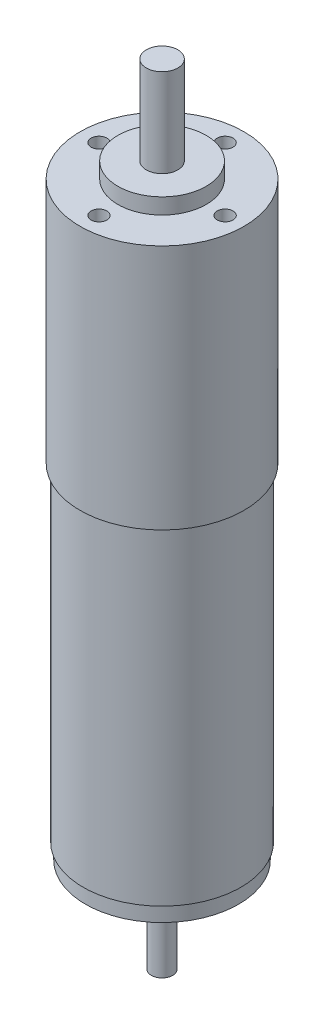
ISO-10303-21;
HEADER;
FILE_DESCRIPTION(('STEP AP214'),'2;1');
FILE_NAME('part.step','',(''),(''),'','','');
FILE_SCHEMA(('AUTOMOTIVE_DESIGN { 1 0 10303 214 1 1 1 1 }'));
ENDSEC;
DATA;
#1=APPLICATION_CONTEXT('core data for automotive mechanical design processes');
#2=APPLICATION_PROTOCOL_DEFINITION('international standard','automotive_design',2000,#1);
#3=PRODUCT_CONTEXT('',#1,'mechanical');
#4=PRODUCT('Part','Part','',(#3));
#5=PRODUCT_RELATED_PRODUCT_CATEGORY('part','',(#4));
#6=PRODUCT_DEFINITION_FORMATION('','',#4);
#7=PRODUCT_DEFINITION_CONTEXT('part definition',#1,'design');
#8=PRODUCT_DEFINITION('design','',#6,#7);
#9=PRODUCT_DEFINITION_SHAPE('','',#8);
#10=(LENGTH_UNIT() NAMED_UNIT(*) SI_UNIT(.MILLI.,.METRE.));
#11=(NAMED_UNIT(*) PLANE_ANGLE_UNIT() SI_UNIT($,.RADIAN.));
#12=(NAMED_UNIT(*) SI_UNIT($,.STERADIAN.) SOLID_ANGLE_UNIT());
#13=UNCERTAINTY_MEASURE_WITH_UNIT(LENGTH_MEASURE(1.E-05),#10,'distance_accuracy_value','');
#14=(GEOMETRIC_REPRESENTATION_CONTEXT(3) GLOBAL_UNCERTAINTY_ASSIGNED_CONTEXT((#13)) GLOBAL_UNIT_ASSIGNED_CONTEXT((#10,
#11,#12)) REPRESENTATION_CONTEXT('',''));
#15=CARTESIAN_POINT('',(0.,0.,0.));
#16=DIRECTION('',(0.,0.,1.));
#17=DIRECTION('',(1.,0.,0.));
#18=AXIS2_PLACEMENT_3D('',#15,#16,#17);
#19=CARTESIAN_POINT('',(0.,0.,0.));
#20=DIRECTION('',(0.,-1.,0.));
#21=DIRECTION('',(0.,0.,-1.));
#22=AXIS2_PLACEMENT_3D('',#19,#20,#21);
#23=PLANE('',#22);
#24=CARTESIAN_POINT('',(0.,0.,0.));
#25=DIRECTION('',(0.,-1.,0.));
#26=DIRECTION('',(0.,0.,-1.));
#27=AXIS2_PLACEMENT_3D('',#24,#25,#26);
#28=CIRCLE('',#27,12.15);
#29=CARTESIAN_POINT('',(0.,0.,-12.15));
#30=VERTEX_POINT('',#29);
#31=EDGE_CURVE('E10',#30,#30,#28,.T.);
#32=ORIENTED_EDGE('',*,*,#31,.T.);
#33=EDGE_LOOP('',(#32));
#34=FACE_BOUND('',#33,.T.);
#35=CARTESIAN_POINT('',(0.,0.,0.));
#36=DIRECTION('',(0.,-1.,0.));
#37=DIRECTION('',(0.,0.,-1.));
#38=AXIS2_PLACEMENT_3D('',#35,#36,#37);
#39=CIRCLE('',#38,4.);
#40=CARTESIAN_POINT('',(0.,0.,-4.));
#41=VERTEX_POINT('',#40);
#42=EDGE_CURVE('E72',#41,#41,#39,.T.);
#43=ORIENTED_EDGE('',*,*,#42,.F.);
#44=EDGE_LOOP('',(#43));
#45=FACE_BOUND('',#44,.T.);
#46=ADVANCED_FACE('F32',(#34,#45),#23,.T.);
#47=CARTESIAN_POINT('',(0.,0.,0.));
#48=DIRECTION('',(0.,-1.,0.));
#49=DIRECTION('',(0.,0.,-1.));
#50=AXIS2_PLACEMENT_3D('',#47,#48,#49);
#51=CYLINDRICAL_SURFACE('',#50,12.15);
#52=CARTESIAN_POINT('',(0.,2.5,0.));
#53=DIRECTION('',(0.,-1.,0.));
#54=DIRECTION('',(0.,0.,-1.));
#55=AXIS2_PLACEMENT_3D('',#52,#53,#54);
#56=CIRCLE('',#55,12.15);
#57=CARTESIAN_POINT('',(0.,2.5,-12.15));
#58=VERTEX_POINT('',#57);
#59=EDGE_CURVE('E39',#58,#58,#56,.T.);
#60=ORIENTED_EDGE('',*,*,#59,.T.);
#61=EDGE_LOOP('',(#60));
#62=FACE_BOUND('',#61,.T.);
#63=ORIENTED_EDGE('',*,*,#31,.F.);
#64=EDGE_LOOP('',(#63));
#65=FACE_BOUND('',#64,.T.);
#66=ADVANCED_FACE('F148',(#62,#65),#51,.T.);
#67=CARTESIAN_POINT('',(12.15,2.5,0.));
#68=DIRECTION('',(0.,-1.,0.));
#69=DIRECTION('',(0.,0.,-1.));
#70=AXIS2_PLACEMENT_3D('',#67,#68,#69);
#71=PLANE('',#70);
#72=CARTESIAN_POINT('',(0.,2.5,0.));
#73=DIRECTION('',(0.,-1.,0.));
#74=DIRECTION('',(0.,0.,-1.));
#75=AXIS2_PLACEMENT_3D('',#72,#73,#74);
#76=CIRCLE('',#75,12.5);
#77=CARTESIAN_POINT('',(0.,2.5,-12.5));
#78=VERTEX_POINT('',#77);
#79=EDGE_CURVE('E43',#78,#78,#76,.T.);
#80=ORIENTED_EDGE('',*,*,#79,.T.);
#81=EDGE_LOOP('',(#80));
#82=FACE_BOUND('',#81,.T.);
#83=ORIENTED_EDGE('',*,*,#59,.F.);
#84=EDGE_LOOP('',(#83));
#85=FACE_BOUND('',#84,.T.);
#86=ADVANCED_FACE('F142',(#82,#85),#71,.T.);
#87=CARTESIAN_POINT('',(0.,0.,0.));
#88=DIRECTION('',(0.,-1.,0.));
#89=DIRECTION('',(0.,0.,-1.));
#90=AXIS2_PLACEMENT_3D('',#87,#88,#89);
#91=CYLINDRICAL_SURFACE('',#90,12.5);
#92=CARTESIAN_POINT('',(0.,54.5,0.));
#93=DIRECTION('',(0.,-1.,0.));
#94=DIRECTION('',(0.,0.,-1.));
#95=AXIS2_PLACEMENT_3D('',#92,#93,#94);
#96=CIRCLE('',#95,12.5);
#97=CARTESIAN_POINT('',(0.,54.5,-12.5));
#98=VERTEX_POINT('',#97);
#99=EDGE_CURVE('E48',#98,#98,#96,.T.);
#100=ORIENTED_EDGE('',*,*,#99,.T.);
#101=EDGE_LOOP('',(#100));
#102=FACE_BOUND('',#101,.T.);
#103=ORIENTED_EDGE('',*,*,#79,.F.);
#104=EDGE_LOOP('',(#103));
#105=FACE_BOUND('',#104,.T.);
#106=ADVANCED_FACE('F136',(#102,#105),#91,.T.);
#107=CARTESIAN_POINT('',(12.5,54.5,0.));
#108=DIRECTION('',(0.,-1.,0.));
#109=DIRECTION('',(0.,0.,-1.));
#110=AXIS2_PLACEMENT_3D('',#107,#108,#109);
#111=PLANE('',#110);
#112=CARTESIAN_POINT('',(0.,54.5,0.));
#113=DIRECTION('',(0.,-1.,0.));
#114=DIRECTION('',(0.,0.,-1.));
#115=AXIS2_PLACEMENT_3D('',#112,#113,#114);
#116=CIRCLE('',#115,13.);
#117=CARTESIAN_POINT('',(0.,54.5,-13.));
#118=VERTEX_POINT('',#117);
#119=EDGE_CURVE('E51',#118,#118,#116,.T.);
#120=ORIENTED_EDGE('',*,*,#119,.T.);
#121=EDGE_LOOP('',(#120));
#122=FACE_BOUND('',#121,.T.);
#123=ORIENTED_EDGE('',*,*,#99,.F.);
#124=EDGE_LOOP('',(#123));
#125=FACE_BOUND('',#124,.T.);
#126=ADVANCED_FACE('F130',(#122,#125),#111,.T.);
#127=CARTESIAN_POINT('',(0.,0.,0.));
#128=DIRECTION('',(0.,-1.,0.));
#129=DIRECTION('',(0.,0.,-1.));
#130=AXIS2_PLACEMENT_3D('',#127,#128,#129);
#131=CYLINDRICAL_SURFACE('',#130,13.);
#132=CARTESIAN_POINT('',(0.,93.5,0.));
#133=DIRECTION('',(0.,-1.,0.));
#134=DIRECTION('',(0.,0.,-1.));
#135=AXIS2_PLACEMENT_3D('',#132,#133,#134);
#136=CIRCLE('',#135,13.);
#137=CARTESIAN_POINT('',(0.,93.5,-13.));
#138=VERTEX_POINT('',#137);
#139=EDGE_CURVE('E54',#138,#138,#136,.T.);
#140=ORIENTED_EDGE('',*,*,#139,.T.);
#141=EDGE_LOOP('',(#140));
#142=FACE_BOUND('',#141,.T.);
#143=ORIENTED_EDGE('',*,*,#119,.F.);
#144=EDGE_LOOP('',(#143));
#145=FACE_BOUND('',#144,.T.);
#146=ADVANCED_FACE('F116',(#142,#145),#131,.T.);
#147=CARTESIAN_POINT('',(13.,93.5,0.));
#148=DIRECTION('',(0.,1.,0.));
#149=DIRECTION('',(0.,0.,1.));
#150=AXIS2_PLACEMENT_3D('',#147,#148,#149);
#151=PLANE('',#150);
#152=CARTESIAN_POINT('',(10.,93.5,0.));
#153=DIRECTION('',(0.,1.,0.));
#154=DIRECTION('',(0.,0.,1.));
#155=AXIS2_PLACEMENT_3D('',#152,#153,#154);
#156=CIRCLE('',#155,1.25);
#157=CARTESIAN_POINT('',(10.,93.5,1.25));
#158=VERTEX_POINT('',#157);
#159=EDGE_CURVE('E97',#158,#158,#156,.T.);
#160=ORIENTED_EDGE('',*,*,#159,.F.);
#161=EDGE_LOOP('',(#160));
#162=FACE_BOUND('',#161,.T.);
#163=CARTESIAN_POINT('',(0.,93.5,10.));
#164=DIRECTION('',(0.,1.,0.));
#165=DIRECTION('',(0.,0.,1.));
#166=AXIS2_PLACEMENT_3D('',#163,#164,#165);
#167=CIRCLE('',#166,1.25);
#168=CARTESIAN_POINT('',(0.,93.5,11.25));
#169=VERTEX_POINT('',#168);
#170=EDGE_CURVE('E91',#169,#169,#167,.T.);
#171=ORIENTED_EDGE('',*,*,#170,.F.);
#172=EDGE_LOOP('',(#171));
#173=FACE_BOUND('',#172,.T.);
#174=CARTESIAN_POINT('',(-10.,93.5,0.));
#175=DIRECTION('',(0.,1.,0.));
#176=DIRECTION('',(0.,0.,1.));
#177=AXIS2_PLACEMENT_3D('',#174,#175,#176);
#178=CIRCLE('',#177,1.25);
#179=CARTESIAN_POINT('',(-10.,93.5,1.25));
#180=VERTEX_POINT('',#179);
#181=EDGE_CURVE('E85',#180,#180,#178,.T.);
#182=ORIENTED_EDGE('',*,*,#181,.F.);
#183=EDGE_LOOP('',(#182));
#184=FACE_BOUND('',#183,.T.);
#185=CARTESIAN_POINT('',(0.,93.5,-10.));
#186=DIRECTION('',(0.,1.,0.));
#187=DIRECTION('',(0.,0.,1.));
#188=AXIS2_PLACEMENT_3D('',#185,#186,#187);
#189=CIRCLE('',#188,1.25);
#190=CARTESIAN_POINT('',(0.,93.5,-8.75));
#191=VERTEX_POINT('',#190);
#192=EDGE_CURVE('E79',#191,#191,#189,.T.);
#193=ORIENTED_EDGE('',*,*,#192,.F.);
#194=EDGE_LOOP('',(#193));
#195=FACE_BOUND('',#194,.T.);
#196=CARTESIAN_POINT('',(0.,93.5,0.));
#197=DIRECTION('',(0.,-1.,0.));
#198=DIRECTION('',(0.,0.,-1.));
#199=AXIS2_PLACEMENT_3D('',#196,#197,#198);
#200=CIRCLE('',#199,7.);
#201=CARTESIAN_POINT('',(0.,93.5,-7.));
#202=VERTEX_POINT('',#201);
#203=EDGE_CURVE('E57',#202,#202,#200,.T.);
#204=ORIENTED_EDGE('',*,*,#203,.T.);
#205=EDGE_LOOP('',(#204));
#206=FACE_BOUND('',#205,.T.);
#207=ORIENTED_EDGE('',*,*,#139,.F.);
#208=EDGE_LOOP('',(#207));
#209=FACE_BOUND('',#208,.T.);
#210=ADVANCED_FACE('F112',(#162,#173,#184,#195,#206,#209),#151,.T.);
#211=CARTESIAN_POINT('',(0.,0.,0.));
#212=DIRECTION('',(0.,-1.,0.));
#213=DIRECTION('',(0.,0.,-1.));
#214=AXIS2_PLACEMENT_3D('',#211,#212,#213);
#215=CYLINDRICAL_SURFACE('',#214,7.);
#216=CARTESIAN_POINT('',(0.,96.,0.));
#217=DIRECTION('',(0.,-1.,0.));
#218=DIRECTION('',(0.,0.,-1.));
#219=AXIS2_PLACEMENT_3D('',#216,#217,#218);
#220=CIRCLE('',#219,7.);
#221=CARTESIAN_POINT('',(0.,96.,-7.));
#222=VERTEX_POINT('',#221);
#223=EDGE_CURVE('E60',#222,#222,#220,.T.);
#224=ORIENTED_EDGE('',*,*,#223,.T.);
#225=EDGE_LOOP('',(#224));
#226=FACE_BOUND('',#225,.T.);
#227=ORIENTED_EDGE('',*,*,#203,.F.);
#228=EDGE_LOOP('',(#227));
#229=FACE_BOUND('',#228,.T.);
#230=ADVANCED_FACE('F115',(#226,#229),#215,.T.);
#231=CARTESIAN_POINT('',(7.,96.,0.));
#232=DIRECTION('',(0.,1.,0.));
#233=DIRECTION('',(0.,0.,1.));
#234=AXIS2_PLACEMENT_3D('',#231,#232,#233);
#235=PLANE('',#234);
#236=CARTESIAN_POINT('',(0.,96.,0.));
#237=DIRECTION('',(0.,-1.,0.));
#238=DIRECTION('',(0.,0.,-1.));
#239=AXIS2_PLACEMENT_3D('',#236,#237,#238);
#240=CIRCLE('',#239,2.5);
#241=CARTESIAN_POINT('',(0.,96.,-2.5));
#242=VERTEX_POINT('',#241);
#243=EDGE_CURVE('E63',#242,#242,#240,.T.);
#244=ORIENTED_EDGE('',*,*,#243,.T.);
#245=EDGE_LOOP('',(#244));
#246=FACE_BOUND('',#245,.T.);
#247=ORIENTED_EDGE('',*,*,#223,.F.);
#248=EDGE_LOOP('',(#247));
#249=FACE_BOUND('',#248,.T.);
#250=ADVANCED_FACE('F160',(#246,#249),#235,.T.);
#251=CARTESIAN_POINT('',(0.,0.,0.));
#252=DIRECTION('',(0.,-1.,0.));
#253=DIRECTION('',(0.,0.,-1.));
#254=AXIS2_PLACEMENT_3D('',#251,#252,#253);
#255=CYLINDRICAL_SURFACE('',#254,2.5);
#256=CARTESIAN_POINT('',(0.,110.,0.));
#257=DIRECTION('',(0.,-1.,0.));
#258=DIRECTION('',(0.,0.,-1.));
#259=AXIS2_PLACEMENT_3D('',#256,#257,#258);
#260=CIRCLE('',#259,2.5);
#261=CARTESIAN_POINT('',(0.,110.,-2.5));
#262=VERTEX_POINT('',#261);
#263=EDGE_CURVE('E66',#262,#262,#260,.T.);
#264=ORIENTED_EDGE('',*,*,#263,.T.);
#265=EDGE_LOOP('',(#264));
#266=FACE_BOUND('',#265,.T.);
#267=ORIENTED_EDGE('',*,*,#243,.F.);
#268=EDGE_LOOP('',(#267));
#269=FACE_BOUND('',#268,.T.);
#270=ADVANCED_FACE('F164',(#266,#269),#255,.T.);
#271=CARTESIAN_POINT('',(2.5,110.,0.));
#272=DIRECTION('',(0.,1.,0.));
#273=DIRECTION('',(0.,0.,1.));
#274=AXIS2_PLACEMENT_3D('',#271,#272,#273);
#275=PLANE('',#274);
#276=ORIENTED_EDGE('',*,*,#263,.F.);
#277=EDGE_LOOP('',(#276));
#278=FACE_BOUND('',#277,.T.);
#279=ADVANCED_FACE('F168',(#278),#275,.T.);
#280=CARTESIAN_POINT('',(0.,-2.5,0.));
#281=DIRECTION('',(0.,-1.,0.));
#282=DIRECTION('',(0.,0.,-1.));
#283=AXIS2_PLACEMENT_3D('',#280,#281,#282);
#284=PLANE('',#283);
#285=CARTESIAN_POINT('',(0.,-2.5,0.));
#286=DIRECTION('',(0.,-1.,0.));
#287=DIRECTION('',(0.,0.,-1.));
#288=AXIS2_PLACEMENT_3D('',#285,#286,#287);
#289=CIRCLE('',#288,4.);
#290=CARTESIAN_POINT('',(0.,-2.5,-4.));
#291=VERTEX_POINT('',#290);
#292=EDGE_CURVE('E75',#291,#291,#289,.T.);
#293=ORIENTED_EDGE('',*,*,#292,.T.);
#294=EDGE_LOOP('',(#293));
#295=FACE_BOUND('',#294,.T.);
#296=CARTESIAN_POINT('',(0.,-2.5,0.));
#297=DIRECTION('',(0.,-1.,0.));
#298=DIRECTION('',(0.,0.,-1.));
#299=AXIS2_PLACEMENT_3D('',#296,#297,#298);
#300=CIRCLE('',#299,1.69275807705358);
#301=CARTESIAN_POINT('',(0.,-2.5,-1.69275807705358));
#302=VERTEX_POINT('',#301);
#303=EDGE_CURVE('E35',#302,#302,#300,.T.);
#304=ORIENTED_EDGE('',*,*,#303,.F.);
#305=EDGE_LOOP('',(#304));
#306=FACE_BOUND('',#305,.T.);
#307=ADVANCED_FACE('F172',(#295,#306),#284,.T.);
#308=CARTESIAN_POINT('',(0.,-2.5,0.));
#309=DIRECTION('',(0.,1.,0.));
#310=DIRECTION('',(0.,0.,1.));
#311=AXIS2_PLACEMENT_3D('',#308,#309,#310);
#312=CYLINDRICAL_SURFACE('',#311,4.);
#313=ORIENTED_EDGE('',*,*,#292,.F.);
#314=EDGE_LOOP('',(#313));
#315=FACE_BOUND('',#314,.T.);
#316=ORIENTED_EDGE('',*,*,#42,.T.);
#317=EDGE_LOOP('',(#316));
#318=FACE_BOUND('',#317,.T.);
#319=ADVANCED_FACE('F182',(#315,#318),#312,.T.);
#320=CARTESIAN_POINT('',(0.,-15.,0.));
#321=DIRECTION('',(0.,-1.,0.));
#322=DIRECTION('',(0.,0.,-1.));
#323=AXIS2_PLACEMENT_3D('',#320,#321,#322);
#324=PLANE('',#323);
#325=CARTESIAN_POINT('',(0.,-15.,0.));
#326=DIRECTION('',(0.,-1.,0.));
#327=DIRECTION('',(0.,0.,-1.));
#328=AXIS2_PLACEMENT_3D('',#325,#326,#327);
#329=CIRCLE('',#328,1.69275807705358);
#330=CARTESIAN_POINT('',(0.,-15.,-1.69275807705358));
#331=VERTEX_POINT('',#330);
#332=EDGE_CURVE('E69',#331,#331,#329,.T.);
#333=ORIENTED_EDGE('',*,*,#332,.T.);
#334=EDGE_LOOP('',(#333));
#335=FACE_BOUND('',#334,.T.);
#336=ADVANCED_FACE('F178',(#335),#324,.T.);
#337=CARTESIAN_POINT('',(0.,-15.,0.));
#338=DIRECTION('',(0.,1.,0.));
#339=DIRECTION('',(0.,0.,1.));
#340=AXIS2_PLACEMENT_3D('',#337,#338,#339);
#341=CYLINDRICAL_SURFACE('',#340,1.69275807705358);
#342=ORIENTED_EDGE('',*,*,#303,.T.);
#343=EDGE_LOOP('',(#342));
#344=FACE_BOUND('',#343,.T.);
#345=ORIENTED_EDGE('',*,*,#332,.F.);
#346=EDGE_LOOP('',(#345));
#347=FACE_BOUND('',#346,.T.);
#348=ADVANCED_FACE('F174',(#344,#347),#341,.T.);
#349=CARTESIAN_POINT('',(0.,88.5,-10.));
#350=DIRECTION('',(0.,1.,0.));
#351=DIRECTION('',(0.,0.,1.));
#352=AXIS2_PLACEMENT_3D('',#349,#350,#351);
#353=CYLINDRICAL_SURFACE('',#352,1.25);
#354=CARTESIAN_POINT('',(0.,88.5,-10.));
#355=DIRECTION('',(0.,1.,0.));
#356=DIRECTION('',(0.,0.,1.));
#357=AXIS2_PLACEMENT_3D('',#354,#355,#356);
#358=CIRCLE('',#357,1.25);
#359=CARTESIAN_POINT('',(0.,88.5,-8.75));
#360=VERTEX_POINT('',#359);
#361=EDGE_CURVE('E76',#360,#360,#358,.T.);
#362=ORIENTED_EDGE('',*,*,#361,.F.);
#363=EDGE_LOOP('',(#362));
#364=FACE_BOUND('',#363,.T.);
#365=ORIENTED_EDGE('',*,*,#192,.T.);
#366=EDGE_LOOP('',(#365));
#367=FACE_BOUND('',#366,.T.);
#368=ADVANCED_FACE('F177',(#364,#367),#353,.F.);
#369=CARTESIAN_POINT('',(0.,88.5,-10.));
#370=DIRECTION('',(0.,1.,0.));
#371=DIRECTION('',(0.,0.,1.));
#372=AXIS2_PLACEMENT_3D('',#369,#370,#371);
#373=PLANE('',#372);
#374=ORIENTED_EDGE('',*,*,#361,.T.);
#375=EDGE_LOOP('',(#374));
#376=FACE_BOUND('',#375,.T.);
#377=ADVANCED_FACE('F192',(#376),#373,.T.);
#378=CARTESIAN_POINT('',(-10.,88.5,0.));
#379=DIRECTION('',(0.,1.,0.));
#380=DIRECTION('',(0.,0.,1.));
#381=AXIS2_PLACEMENT_3D('',#378,#379,#380);
#382=CYLINDRICAL_SURFACE('',#381,1.25);
#383=CARTESIAN_POINT('',(-10.,88.5,0.));
#384=DIRECTION('',(0.,1.,0.));
#385=DIRECTION('',(0.,0.,1.));
#386=AXIS2_PLACEMENT_3D('',#383,#384,#385);
#387=CIRCLE('',#386,1.25);
#388=CARTESIAN_POINT('',(-10.,88.5,1.25));
#389=VERTEX_POINT('',#388);
#390=EDGE_CURVE('E88',#389,#389,#387,.T.);
#391=ORIENTED_EDGE('',*,*,#390,.F.);
#392=EDGE_LOOP('',(#391));
#393=FACE_BOUND('',#392,.T.);
#394=ORIENTED_EDGE('',*,*,#181,.T.);
#395=EDGE_LOOP('',(#394));
#396=FACE_BOUND('',#395,.T.);
#397=ADVANCED_FACE('F196',(#393,#396),#382,.F.);
#398=CARTESIAN_POINT('',(-10.,88.5,0.));
#399=DIRECTION('',(0.,1.,0.));
#400=DIRECTION('',(0.,0.,1.));
#401=AXIS2_PLACEMENT_3D('',#398,#399,#400);
#402=PLANE('',#401);
#403=ORIENTED_EDGE('',*,*,#390,.T.);
#404=EDGE_LOOP('',(#403));
#405=FACE_BOUND('',#404,.T.);
#406=ADVANCED_FACE('F200',(#405),#402,.T.);
#407=CARTESIAN_POINT('',(0.,88.5,10.));
#408=DIRECTION('',(0.,1.,0.));
#409=DIRECTION('',(0.,0.,1.));
#410=AXIS2_PLACEMENT_3D('',#407,#408,#409);
#411=CYLINDRICAL_SURFACE('',#410,1.25);
#412=CARTESIAN_POINT('',(0.,88.5,10.));
#413=DIRECTION('',(0.,1.,0.));
#414=DIRECTION('',(0.,0.,1.));
#415=AXIS2_PLACEMENT_3D('',#412,#413,#414);
#416=CIRCLE('',#415,1.25);
#417=CARTESIAN_POINT('',(0.,88.5,11.25));
#418=VERTEX_POINT('',#417);
#419=EDGE_CURVE('E94',#418,#418,#416,.T.);
#420=ORIENTED_EDGE('',*,*,#419,.F.);
#421=EDGE_LOOP('',(#420));
#422=FACE_BOUND('',#421,.T.);
#423=ORIENTED_EDGE('',*,*,#170,.T.);
#424=EDGE_LOOP('',(#423));
#425=FACE_BOUND('',#424,.T.);
#426=ADVANCED_FACE('F204',(#422,#425),#411,.F.);
#427=CARTESIAN_POINT('',(0.,88.5,10.));
#428=DIRECTION('',(0.,1.,0.));
#429=DIRECTION('',(0.,0.,1.));
#430=AXIS2_PLACEMENT_3D('',#427,#428,#429);
#431=PLANE('',#430);
#432=ORIENTED_EDGE('',*,*,#419,.T.);
#433=EDGE_LOOP('',(#432));
#434=FACE_BOUND('',#433,.T.);
#435=ADVANCED_FACE('F108',(#434),#431,.T.);
#436=CARTESIAN_POINT('',(10.,88.5,0.));
#437=DIRECTION('',(0.,1.,0.));
#438=DIRECTION('',(0.,0.,1.));
#439=AXIS2_PLACEMENT_3D('',#436,#437,#438);
#440=CYLINDRICAL_SURFACE('',#439,1.25);
#441=CARTESIAN_POINT('',(10.,88.5,0.));
#442=DIRECTION('',(0.,1.,0.));
#443=DIRECTION('',(0.,0.,1.));
#444=AXIS2_PLACEMENT_3D('',#441,#442,#443);
#445=CIRCLE('',#444,1.25);
#446=CARTESIAN_POINT('',(10.,88.5,1.25));
#447=VERTEX_POINT('',#446);
#448=EDGE_CURVE('E82',#447,#447,#445,.T.);
#449=ORIENTED_EDGE('',*,*,#448,.F.);
#450=EDGE_LOOP('',(#449));
#451=FACE_BOUND('',#450,.T.);
#452=ORIENTED_EDGE('',*,*,#159,.T.);
#453=EDGE_LOOP('',(#452));
#454=FACE_BOUND('',#453,.T.);
#455=ADVANCED_FACE('F105',(#451,#454),#440,.F.);
#456=CARTESIAN_POINT('',(10.,88.5,0.));
#457=DIRECTION('',(0.,1.,0.));
#458=DIRECTION('',(0.,0.,1.));
#459=AXIS2_PLACEMENT_3D('',#456,#457,#458);
#460=PLANE('',#459);
#461=ORIENTED_EDGE('',*,*,#448,.T.);
#462=EDGE_LOOP('',(#461));
#463=FACE_BOUND('',#462,.T.);
#464=ADVANCED_FACE('F103',(#463),#460,.T.);
#465=CLOSED_SHELL('',(#46,#66,#86,#106,#126,#146,#210,#230,#250,#270,#279,#307,#319,#336,#348,
#368,#377,#397,#406,#426,#435,#455,#464));
#466=MANIFOLD_SOLID_BREP('B2',#465);
#467=ADVANCED_BREP_SHAPE_REPRESENTATION('',(#18,#466),#14);
#468=SHAPE_DEFINITION_REPRESENTATION(#9,#467);
ENDSEC;
END-ISO-10303-21;
